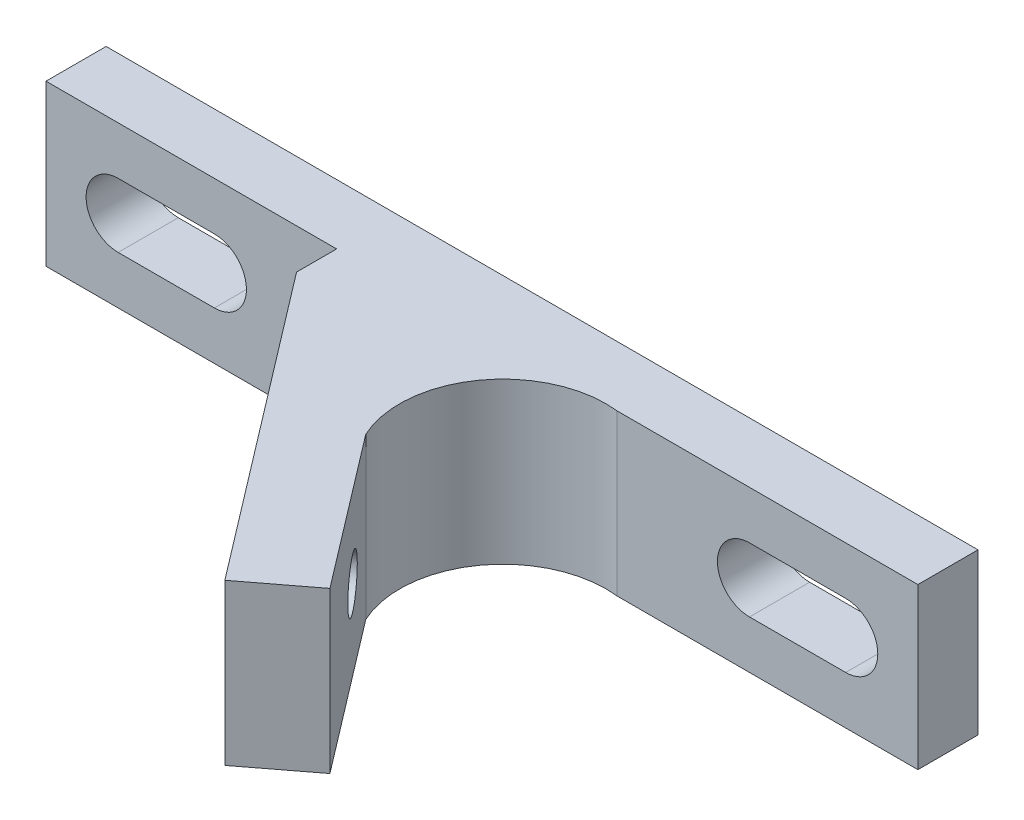
ISO-10303-21;
HEADER;
FILE_DESCRIPTION(('STEP AP214'),'2;1');
FILE_NAME('part.step','',(''),(''),'','','');
FILE_SCHEMA(('AUTOMOTIVE_DESIGN { 1 0 10303 214 1 1 1 1 }'));
ENDSEC;
DATA;
#1=APPLICATION_CONTEXT('core data for automotive mechanical design processes');
#2=APPLICATION_PROTOCOL_DEFINITION('international standard','automotive_design',2000,#1);
#3=PRODUCT_CONTEXT('',#1,'mechanical');
#4=PRODUCT('Part','Part','',(#3));
#5=PRODUCT_RELATED_PRODUCT_CATEGORY('part','',(#4));
#6=PRODUCT_DEFINITION_FORMATION('','',#4);
#7=PRODUCT_DEFINITION_CONTEXT('part definition',#1,'design');
#8=PRODUCT_DEFINITION('design','',#6,#7);
#9=PRODUCT_DEFINITION_SHAPE('','',#8);
#10=(LENGTH_UNIT() NAMED_UNIT(*) SI_UNIT(.MILLI.,.METRE.));
#11=(NAMED_UNIT(*) PLANE_ANGLE_UNIT() SI_UNIT($,.RADIAN.));
#12=(NAMED_UNIT(*) SI_UNIT($,.STERADIAN.) SOLID_ANGLE_UNIT());
#13=UNCERTAINTY_MEASURE_WITH_UNIT(LENGTH_MEASURE(1.E-05),#10,'distance_accuracy_value','');
#14=(GEOMETRIC_REPRESENTATION_CONTEXT(3) GLOBAL_UNCERTAINTY_ASSIGNED_CONTEXT((#13)) GLOBAL_UNIT_ASSIGNED_CONTEXT((#10,
#11,#12)) REPRESENTATION_CONTEXT('',''));
#15=CARTESIAN_POINT('',(0.,0.,0.));
#16=DIRECTION('',(0.,0.,1.));
#17=DIRECTION('',(1.,0.,0.));
#18=AXIS2_PLACEMENT_3D('',#15,#16,#17);
#19=CARTESIAN_POINT('',(-21.75,8.,0.));
#20=DIRECTION('',(1.,0.,0.));
#21=DIRECTION('',(0.,0.,-1.));
#22=AXIS2_PLACEMENT_3D('',#19,#20,#21);
#23=PLANE('',#22);
#24=DIRECTION('',(0.,0.,1.));
#25=VECTOR('',#24,1.);
#26=CARTESIAN_POINT('',(-21.75,0.,0.));
#27=LINE('',#26,#25);
#28=CARTESIAN_POINT('',(-21.75,0.,0.));
#29=VERTEX_POINT('',#28);
#30=CARTESIAN_POINT('',(-21.75,0.,3.));
#31=VERTEX_POINT('',#30);
#32=EDGE_CURVE('E227',#29,#31,#27,.T.);
#33=ORIENTED_EDGE('',*,*,#32,.T.);
#34=DIRECTION('',(0.,-1.,0.));
#35=VECTOR('',#34,1.);
#36=CARTESIAN_POINT('',(-21.75,8.,3.));
#37=LINE('',#36,#35);
#38=CARTESIAN_POINT('',(-21.75,8.,3.));
#39=VERTEX_POINT('',#38);
#40=EDGE_CURVE('E11',#39,#31,#37,.T.);
#41=ORIENTED_EDGE('',*,*,#40,.F.);
#42=DIRECTION('',(0.,0.,1.));
#43=VECTOR('',#42,1.);
#44=CARTESIAN_POINT('',(-21.75,8.,0.));
#45=LINE('',#44,#43);
#46=CARTESIAN_POINT('',(-21.75,8.,0.));
#47=VERTEX_POINT('',#46);
#48=EDGE_CURVE('E228',#47,#39,#45,.T.);
#49=ORIENTED_EDGE('',*,*,#48,.F.);
#50=DIRECTION('',(0.,-1.,0.));
#51=VECTOR('',#50,1.);
#52=CARTESIAN_POINT('',(-21.75,8.,0.));
#53=LINE('',#52,#51);
#54=EDGE_CURVE('E250',#47,#29,#53,.T.);
#55=ORIENTED_EDGE('',*,*,#54,.T.);
#56=EDGE_LOOP('',(#33,#41,#49,#55));
#57=FACE_BOUND('',#56,.T.);
#58=ADVANCED_FACE('F35',(#57),#23,.F.);
#59=CARTESIAN_POINT('',(-21.75,8.,3.));
#60=DIRECTION('',(0.,0.,-1.));
#61=DIRECTION('',(-1.,0.,0.));
#62=AXIS2_PLACEMENT_3D('',#59,#60,#61);
#63=PLANE('',#62);
#64=DIRECTION('',(1.,0.,0.));
#65=VECTOR('',#64,1.);
#66=CARTESIAN_POINT('',(-18.15,2.4,3.));
#67=LINE('',#66,#65);
#68=CARTESIAN_POINT('',(-18.15,2.4,3.));
#69=VERTEX_POINT('',#68);
#70=CARTESIAN_POINT('',(-13.35,2.4,3.));
#71=VERTEX_POINT('',#70);
#72=EDGE_CURVE('E180',#69,#71,#67,.T.);
#73=ORIENTED_EDGE('',*,*,#72,.F.);
#74=CARTESIAN_POINT('',(-18.15,4.,3.));
#75=DIRECTION('',(0.,0.,-1.));
#76=DIRECTION('',(-1.,0.,0.));
#77=AXIS2_PLACEMENT_3D('',#74,#75,#76);
#78=CIRCLE('',#77,1.6);
#79=CARTESIAN_POINT('',(-18.15,5.6,3.));
#80=VERTEX_POINT('',#79);
#81=EDGE_CURVE('E162',#80,#69,#78,.F.);
#82=ORIENTED_EDGE('',*,*,#81,.F.);
#83=DIRECTION('',(-1.,0.,0.));
#84=VECTOR('',#83,1.);
#85=CARTESIAN_POINT('',(-18.15,5.6,3.));
#86=LINE('',#85,#84);
#87=CARTESIAN_POINT('',(-13.35,5.6,3.));
#88=VERTEX_POINT('',#87);
#89=EDGE_CURVE('E171',#88,#80,#86,.T.);
#90=ORIENTED_EDGE('',*,*,#89,.F.);
#91=CARTESIAN_POINT('',(-13.35,4.,3.));
#92=DIRECTION('',(0.,0.,-1.));
#93=DIRECTION('',(-1.,0.,0.));
#94=AXIS2_PLACEMENT_3D('',#91,#92,#93);
#95=CIRCLE('',#94,1.6);
#96=EDGE_CURVE('E50',#71,#88,#95,.F.);
#97=ORIENTED_EDGE('',*,*,#96,.F.);
#98=EDGE_LOOP('',(#73,#82,#90,#97));
#99=FACE_BOUND('',#98,.T.);
#100=DIRECTION('',(1.,0.,0.));
#101=VECTOR('',#100,1.);
#102=CARTESIAN_POINT('',(-21.75,0.,3.));
#103=LINE('',#102,#101);
#104=CARTESIAN_POINT('',(-7.25000000000001,0.,3.));
#105=VERTEX_POINT('',#104);
#106=EDGE_CURVE('E253',#31,#105,#103,.T.);
#107=ORIENTED_EDGE('',*,*,#106,.T.);
#108=DIRECTION('',(0.,-1.,0.));
#109=VECTOR('',#108,1.);
#110=CARTESIAN_POINT('',(-7.25000000000001,8.,3.));
#111=LINE('',#110,#109);
#112=CARTESIAN_POINT('',(-7.25000000000001,8.,3.));
#113=VERTEX_POINT('',#112);
#114=EDGE_CURVE('E43',#113,#105,#111,.T.);
#115=ORIENTED_EDGE('',*,*,#114,.F.);
#116=DIRECTION('',(1.,0.,0.));
#117=VECTOR('',#116,1.);
#118=CARTESIAN_POINT('',(-21.75,8.,3.));
#119=LINE('',#118,#117);
#120=EDGE_CURVE('E231',#39,#113,#119,.T.);
#121=ORIENTED_EDGE('',*,*,#120,.F.);
#122=ORIENTED_EDGE('',*,*,#40,.T.);
#123=EDGE_LOOP('',(#107,#115,#121,#122));
#124=FACE_BOUND('',#123,.T.);
#125=ADVANCED_FACE('F177',(#99,#124),#63,.F.);
#126=CARTESIAN_POINT('',(-7.25000000000001,8.,3.));
#127=DIRECTION('',(1.,0.,0.));
#128=DIRECTION('',(0.,0.,-1.));
#129=AXIS2_PLACEMENT_3D('',#126,#127,#128);
#130=PLANE('',#129);
#131=DIRECTION('',(0.,0.,1.));
#132=VECTOR('',#131,1.);
#133=CARTESIAN_POINT('',(-7.25000000000001,0.,3.));
#134=LINE('',#133,#132);
#135=CARTESIAN_POINT('',(-7.25,0.,5.));
#136=VERTEX_POINT('',#135);
#137=EDGE_CURVE('E255',#105,#136,#134,.T.);
#138=ORIENTED_EDGE('',*,*,#137,.T.);
#139=DIRECTION('',(0.,-1.,0.));
#140=VECTOR('',#139,1.);
#141=CARTESIAN_POINT('',(-7.25,8.,5.));
#142=LINE('',#141,#140);
#143=CARTESIAN_POINT('',(-7.25,8.,5.));
#144=VERTEX_POINT('',#143);
#145=EDGE_CURVE('E290',#144,#136,#142,.T.);
#146=ORIENTED_EDGE('',*,*,#145,.F.);
#147=DIRECTION('',(0.,0.,1.));
#148=VECTOR('',#147,1.);
#149=CARTESIAN_POINT('',(-7.25000000000001,8.,3.));
#150=LINE('',#149,#148);
#151=EDGE_CURVE('E234',#113,#144,#150,.T.);
#152=ORIENTED_EDGE('',*,*,#151,.F.);
#153=ORIENTED_EDGE('',*,*,#114,.T.);
#154=EDGE_LOOP('',(#138,#146,#152,#153));
#155=FACE_BOUND('',#154,.T.);
#156=ADVANCED_FACE('F298',(#155),#130,.F.);
#157=CARTESIAN_POINT('',(-7.25,8.,5.));
#158=DIRECTION('',(0.794951704580711,0.,-0.606672718509925));
#159=DIRECTION('',(-0.606672718509925,0.,-0.794951704580711));
#160=AXIS2_PLACEMENT_3D('',#157,#158,#159);
#161=PLANE('',#160);
#162=CARTESIAN_POINT('',(-5.12664548521527,4.,7.78233096603249));
#163=DIRECTION('',(-0.794951704580711,0.,0.606672718509925));
#164=DIRECTION('',(0.606672718509925,0.,0.794951704580711));
#165=AXIS2_PLACEMENT_3D('',#162,#163,#164);
#166=CIRCLE('',#165,1.25);
#167=CARTESIAN_POINT('',(-4.36830458707786,4.,8.77602059675838));
#168=VERTEX_POINT('',#167);
#169=EDGE_CURVE('E369',#168,#168,#166,.T.);
#170=ORIENTED_EDGE('',*,*,#169,.F.);
#171=EDGE_LOOP('',(#170));
#172=FACE_BOUND('',#171,.T.);
#173=CARTESIAN_POINT('',(0.636745340629017,4.,15.3343721595492));
#174=DIRECTION('',(-0.794951704580711,0.,0.606672718509925));
#175=DIRECTION('',(0.606672718509925,0.,0.794951704580711));
#176=AXIS2_PLACEMENT_3D('',#173,#174,#175);
#177=CIRCLE('',#176,1.25);
#178=CARTESIAN_POINT('',(1.39508623876642,4.,16.3280617902751));
#179=VERTEX_POINT('',#178);
#180=EDGE_CURVE('E372',#179,#179,#177,.T.);
#181=ORIENTED_EDGE('',*,*,#180,.F.);
#182=EDGE_LOOP('',(#181));
#183=FACE_BOUND('',#182,.T.);
#184=DIRECTION('',(0.606672718509925,0.,0.794951704580711));
#185=VECTOR('',#184,1.);
#186=CARTESIAN_POINT('',(-7.25,0.,5.));
#187=LINE('',#186,#185);
#188=CARTESIAN_POINT('',(4.27678165168857,0.,20.1040823870335));
#189=VERTEX_POINT('',#188);
#190=EDGE_CURVE('E257',#136,#189,#187,.T.);
#191=ORIENTED_EDGE('',*,*,#190,.T.);
#192=DIRECTION('',(0.,-1.,0.));
#193=VECTOR('',#192,1.);
#194=CARTESIAN_POINT('',(4.27678165168857,8.,20.1040823870335));
#195=LINE('',#194,#193);
#196=CARTESIAN_POINT('',(4.27678165168857,8.,20.1040823870335));
#197=VERTEX_POINT('',#196);
#198=EDGE_CURVE('E287',#197,#189,#195,.T.);
#199=ORIENTED_EDGE('',*,*,#198,.F.);
#200=DIRECTION('',(0.606672718509925,0.,0.794951704580711));
#201=VECTOR('',#200,1.);
#202=CARTESIAN_POINT('',(-7.25,8.,5.));
#203=LINE('',#202,#201);
#204=EDGE_CURVE('E236',#144,#197,#203,.T.);
#205=ORIENTED_EDGE('',*,*,#204,.F.);
#206=ORIENTED_EDGE('',*,*,#145,.T.);
#207=EDGE_LOOP('',(#191,#199,#205,#206));
#208=FACE_BOUND('',#207,.T.);
#209=ADVANCED_FACE('F308',(#172,#183,#208),#161,.F.);
#210=CARTESIAN_POINT('',(4.27678165168857,8.,20.1040823870335));
#211=DIRECTION('',(-0.606672718509925,0.,-0.794951704580711));
#212=DIRECTION('',(-0.794951704580711,0.,0.606672718509925));
#213=AXIS2_PLACEMENT_3D('',#210,#211,#212);
#214=PLANE('',#213);
#215=DIRECTION('',(0.794951704580711,0.,-0.606672718509925));
#216=VECTOR('',#215,1.);
#217=CARTESIAN_POINT('',(4.27678165168857,0.,20.1040823870335));
#218=LINE('',#217,#216);
#219=CARTESIAN_POINT('',(7.25,0.,17.8350508877614));
#220=VERTEX_POINT('',#219);
#221=EDGE_CURVE('E259',#189,#220,#218,.T.);
#222=ORIENTED_EDGE('',*,*,#221,.T.);
#223=DIRECTION('',(0.,-1.,0.));
#224=VECTOR('',#223,1.);
#225=CARTESIAN_POINT('',(7.25,8.,17.8350508877614));
#226=LINE('',#225,#224);
#227=CARTESIAN_POINT('',(7.25,8.,17.8350508877614));
#228=VERTEX_POINT('',#227);
#229=EDGE_CURVE('E284',#228,#220,#226,.T.);
#230=ORIENTED_EDGE('',*,*,#229,.F.);
#231=DIRECTION('',(0.794951704580711,0.,-0.606672718509925));
#232=VECTOR('',#231,1.);
#233=CARTESIAN_POINT('',(4.27678165168857,8.,20.1040823870335));
#234=LINE('',#233,#232);
#235=EDGE_CURVE('E238',#197,#228,#234,.T.);
#236=ORIENTED_EDGE('',*,*,#235,.F.);
#237=ORIENTED_EDGE('',*,*,#198,.T.);
#238=EDGE_LOOP('',(#222,#230,#236,#237));
#239=FACE_BOUND('',#238,.T.);
#240=ADVANCED_FACE('F312',(#239),#214,.F.);
#241=CARTESIAN_POINT('',(7.25,8.,17.8350508877614));
#242=DIRECTION('',(-0.794951704580711,0.,0.606672718509925));
#243=DIRECTION('',(0.606672718509925,0.,0.794951704580711));
#244=AXIS2_PLACEMENT_3D('',#241,#242,#243);
#245=PLANE('',#244);
#246=CARTESIAN_POINT('',(3.60996368894045,4.,13.0653406602771));
#247=DIRECTION('',(-0.794951704580711,0.,0.606672718509925));
#248=DIRECTION('',(0.606672718509925,0.,0.794951704580711));
#249=AXIS2_PLACEMENT_3D('',#246,#247,#248);
#250=CIRCLE('',#249,1.25);
#251=CARTESIAN_POINT('',(4.36830458707786,4.,14.059030291003));
#252=VERTEX_POINT('',#251);
#253=EDGE_CURVE('E38',#252,#252,#250,.T.);
#254=ORIENTED_EDGE('',*,*,#253,.T.);
#255=EDGE_LOOP('',(#254));
#256=FACE_BOUND('',#255,.T.);
#257=DIRECTION('',(-0.606672718509925,0.,-0.794951704580711));
#258=VECTOR('',#257,1.);
#259=CARTESIAN_POINT('',(7.25,0.,17.8350508877614));
#260=LINE('',#259,#258);
#261=CARTESIAN_POINT('',(1.48660917415571,0.,10.2830096942446));
#262=VERTEX_POINT('',#261);
#263=EDGE_CURVE('E261',#220,#262,#260,.T.);
#264=ORIENTED_EDGE('',*,*,#263,.T.);
#265=DIRECTION('',(0.,-1.,0.));
#266=VECTOR('',#265,1.);
#267=CARTESIAN_POINT('',(1.48660917415571,8.,10.2830096942446));
#268=LINE('',#267,#266);
#269=CARTESIAN_POINT('',(1.48660917415571,8.,10.2830096942446));
#270=VERTEX_POINT('',#269);
#271=EDGE_CURVE('E281',#270,#262,#268,.T.);
#272=ORIENTED_EDGE('',*,*,#271,.F.);
#273=DIRECTION('',(-0.606672718509925,0.,-0.794951704580711));
#274=VECTOR('',#273,1.);
#275=CARTESIAN_POINT('',(7.25,8.,17.8350508877614));
#276=LINE('',#275,#274);
#277=EDGE_CURVE('E240',#228,#270,#276,.T.);
#278=ORIENTED_EDGE('',*,*,#277,.F.);
#279=ORIENTED_EDGE('',*,*,#229,.T.);
#280=EDGE_LOOP('',(#264,#272,#278,#279));
#281=FACE_BOUND('',#280,.T.);
#282=ADVANCED_FACE('F342',(#256,#281),#245,.F.);
#283=CARTESIAN_POINT('',(6.15967015204307,8.,8.11678845072965));
#284=DIRECTION('',(0.,-1.,0.));
#285=DIRECTION('',(0.,0.,-1.));
#286=AXIS2_PLACEMENT_3D('',#283,#284,#285);
#287=CYLINDRICAL_SURFACE('',#286,5.15072940260981);
#288=CARTESIAN_POINT('',(6.15967015204307,0.,8.11678845072965));
#289=DIRECTION('',(0.,-1.,0.));
#290=DIRECTION('',(0.,0.,-1.));
#291=AXIS2_PLACEMENT_3D('',#288,#289,#290);
#292=CIRCLE('',#291,5.15072940260981);
#293=CARTESIAN_POINT('',(6.75,0.,3.));
#294=VERTEX_POINT('',#293);
#295=EDGE_CURVE('E263',#262,#294,#292,.T.);
#296=ORIENTED_EDGE('',*,*,#295,.T.);
#297=DIRECTION('',(0.,-1.,0.));
#298=VECTOR('',#297,1.);
#299=CARTESIAN_POINT('',(6.75,8.,3.));
#300=LINE('',#299,#298);
#301=CARTESIAN_POINT('',(6.75,8.,3.));
#302=VERTEX_POINT('',#301);
#303=EDGE_CURVE('E278',#302,#294,#300,.T.);
#304=ORIENTED_EDGE('',*,*,#303,.F.);
#305=CARTESIAN_POINT('',(6.15967015204307,8.,8.11678845072965));
#306=DIRECTION('',(0.,-1.,0.));
#307=DIRECTION('',(0.,0.,-1.));
#308=AXIS2_PLACEMENT_3D('',#305,#306,#307);
#309=CIRCLE('',#308,5.15072940260981);
#310=EDGE_CURVE('E242',#270,#302,#309,.T.);
#311=ORIENTED_EDGE('',*,*,#310,.F.);
#312=ORIENTED_EDGE('',*,*,#271,.T.);
#313=EDGE_LOOP('',(#296,#304,#311,#312));
#314=FACE_BOUND('',#313,.T.);
#315=ADVANCED_FACE('F339',(#314),#287,.F.);
#316=CARTESIAN_POINT('',(21.75,8.,3.));
#317=DIRECTION('',(0.,0.,-1.));
#318=DIRECTION('',(-1.,0.,0.));
#319=AXIS2_PLACEMENT_3D('',#316,#317,#318);
#320=PLANE('',#319);
#321=DIRECTION('',(-1.,0.,0.));
#322=VECTOR('',#321,1.);
#323=CARTESIAN_POINT('',(18.15,5.6,3.));
#324=LINE('',#323,#322);
#325=CARTESIAN_POINT('',(18.15,5.6,3.));
#326=VERTEX_POINT('',#325);
#327=CARTESIAN_POINT('',(13.35,5.6,3.));
#328=VERTEX_POINT('',#327);
#329=EDGE_CURVE('E198',#326,#328,#324,.T.);
#330=ORIENTED_EDGE('',*,*,#329,.F.);
#331=CARTESIAN_POINT('',(18.15,4.,3.));
#332=DIRECTION('',(0.,0.,-1.));
#333=DIRECTION('',(-1.,0.,0.));
#334=AXIS2_PLACEMENT_3D('',#331,#332,#333);
#335=CIRCLE('',#334,1.6);
#336=CARTESIAN_POINT('',(18.15,2.4,3.));
#337=VERTEX_POINT('',#336);
#338=EDGE_CURVE('E201',#337,#326,#335,.F.);
#339=ORIENTED_EDGE('',*,*,#338,.F.);
#340=DIRECTION('',(1.,0.,0.));
#341=VECTOR('',#340,1.);
#342=CARTESIAN_POINT('',(18.15,2.4,3.));
#343=LINE('',#342,#341);
#344=CARTESIAN_POINT('',(13.35,2.4,3.));
#345=VERTEX_POINT('',#344);
#346=EDGE_CURVE('E218',#345,#337,#343,.T.);
#347=ORIENTED_EDGE('',*,*,#346,.F.);
#348=CARTESIAN_POINT('',(13.35,4.,3.));
#349=DIRECTION('',(0.,0.,-1.));
#350=DIRECTION('',(-1.,0.,0.));
#351=AXIS2_PLACEMENT_3D('',#348,#349,#350);
#352=CIRCLE('',#351,1.6);
#353=EDGE_CURVE('E174',#328,#345,#352,.F.);
#354=ORIENTED_EDGE('',*,*,#353,.F.);
#355=EDGE_LOOP('',(#330,#339,#347,#354));
#356=FACE_BOUND('',#355,.T.);
#357=DIRECTION('',(1.,0.,0.));
#358=VECTOR('',#357,1.);
#359=CARTESIAN_POINT('',(21.75,0.,3.));
#360=LINE('',#359,#358);
#361=CARTESIAN_POINT('',(21.75,0.,3.));
#362=VERTEX_POINT('',#361);
#363=EDGE_CURVE('E265',#294,#362,#360,.T.);
#364=ORIENTED_EDGE('',*,*,#363,.T.);
#365=DIRECTION('',(0.,-1.,0.));
#366=VECTOR('',#365,1.);
#367=CARTESIAN_POINT('',(21.75,8.,3.));
#368=LINE('',#367,#366);
#369=CARTESIAN_POINT('',(21.75,8.,3.));
#370=VERTEX_POINT('',#369);
#371=EDGE_CURVE('E275',#370,#362,#368,.T.);
#372=ORIENTED_EDGE('',*,*,#371,.F.);
#373=DIRECTION('',(1.,0.,0.));
#374=VECTOR('',#373,1.);
#375=CARTESIAN_POINT('',(21.75,8.,3.));
#376=LINE('',#375,#374);
#377=EDGE_CURVE('E244',#302,#370,#376,.T.);
#378=ORIENTED_EDGE('',*,*,#377,.F.);
#379=ORIENTED_EDGE('',*,*,#303,.T.);
#380=EDGE_LOOP('',(#364,#372,#378,#379));
#381=FACE_BOUND('',#380,.T.);
#382=ADVANCED_FACE('F335',(#356,#381),#320,.F.);
#383=CARTESIAN_POINT('',(21.75,8.,0.));
#384=DIRECTION('',(-1.,0.,0.));
#385=DIRECTION('',(0.,0.,1.));
#386=AXIS2_PLACEMENT_3D('',#383,#384,#385);
#387=PLANE('',#386);
#388=DIRECTION('',(0.,0.,-1.));
#389=VECTOR('',#388,1.);
#390=CARTESIAN_POINT('',(21.75,0.,0.));
#391=LINE('',#390,#389);
#392=CARTESIAN_POINT('',(21.75,0.,0.));
#393=VERTEX_POINT('',#392);
#394=EDGE_CURVE('E267',#362,#393,#391,.T.);
#395=ORIENTED_EDGE('',*,*,#394,.T.);
#396=DIRECTION('',(0.,-1.,0.));
#397=VECTOR('',#396,1.);
#398=CARTESIAN_POINT('',(21.75,8.,0.));
#399=LINE('',#398,#397);
#400=CARTESIAN_POINT('',(21.75,8.,0.));
#401=VERTEX_POINT('',#400);
#402=EDGE_CURVE('E272',#401,#393,#399,.T.);
#403=ORIENTED_EDGE('',*,*,#402,.F.);
#404=DIRECTION('',(0.,0.,-1.));
#405=VECTOR('',#404,1.);
#406=CARTESIAN_POINT('',(21.75,8.,0.));
#407=LINE('',#406,#405);
#408=EDGE_CURVE('E246',#370,#401,#407,.T.);
#409=ORIENTED_EDGE('',*,*,#408,.F.);
#410=ORIENTED_EDGE('',*,*,#371,.T.);
#411=EDGE_LOOP('',(#395,#403,#409,#410));
#412=FACE_BOUND('',#411,.T.);
#413=ADVANCED_FACE('F331',(#412),#387,.F.);
#414=CARTESIAN_POINT('',(-21.75,8.,0.));
#415=DIRECTION('',(0.,0.,1.));
#416=DIRECTION('',(1.,0.,0.));
#417=AXIS2_PLACEMENT_3D('',#414,#415,#416);
#418=PLANE('',#417);
#419=DIRECTION('',(1.,0.,0.));
#420=VECTOR('',#419,1.);
#421=CARTESIAN_POINT('',(-18.15,5.6,0.));
#422=LINE('',#421,#420);
#423=CARTESIAN_POINT('',(-18.15,5.6,0.));
#424=VERTEX_POINT('',#423);
#425=CARTESIAN_POINT('',(-13.35,5.6,0.));
#426=VERTEX_POINT('',#425);
#427=EDGE_CURVE('E182',#424,#426,#422,.T.);
#428=ORIENTED_EDGE('',*,*,#427,.F.);
#429=CARTESIAN_POINT('',(-18.15,4.,0.));
#430=DIRECTION('',(0.,0.,-1.));
#431=DIRECTION('',(1.,0.,0.));
#432=AXIS2_PLACEMENT_3D('',#429,#430,#431);
#433=CIRCLE('',#432,1.6);
#434=CARTESIAN_POINT('',(-18.15,2.4,0.));
#435=VERTEX_POINT('',#434);
#436=EDGE_CURVE('E58',#435,#424,#433,.T.);
#437=ORIENTED_EDGE('',*,*,#436,.F.);
#438=DIRECTION('',(-1.,0.,0.));
#439=VECTOR('',#438,1.);
#440=CARTESIAN_POINT('',(-18.15,2.4,0.));
#441=LINE('',#440,#439);
#442=CARTESIAN_POINT('',(-13.35,2.4,0.));
#443=VERTEX_POINT('',#442);
#444=EDGE_CURVE('E168',#443,#435,#441,.T.);
#445=ORIENTED_EDGE('',*,*,#444,.F.);
#446=CARTESIAN_POINT('',(-13.35,4.,0.));
#447=DIRECTION('',(0.,0.,-1.));
#448=DIRECTION('',(1.,0.,0.));
#449=AXIS2_PLACEMENT_3D('',#446,#447,#448);
#450=CIRCLE('',#449,1.6);
#451=EDGE_CURVE('E188',#426,#443,#450,.T.);
#452=ORIENTED_EDGE('',*,*,#451,.F.);
#453=EDGE_LOOP('',(#428,#437,#445,#452));
#454=FACE_BOUND('',#453,.T.);
#455=DIRECTION('',(-1.,0.,0.));
#456=VECTOR('',#455,1.);
#457=CARTESIAN_POINT('',(18.15,2.4,0.));
#458=LINE('',#457,#456);
#459=CARTESIAN_POINT('',(18.15,2.4,0.));
#460=VERTEX_POINT('',#459);
#461=CARTESIAN_POINT('',(13.35,2.4,0.));
#462=VERTEX_POINT('',#461);
#463=EDGE_CURVE('E206',#460,#462,#458,.T.);
#464=ORIENTED_EDGE('',*,*,#463,.F.);
#465=CARTESIAN_POINT('',(18.15,4.,0.));
#466=DIRECTION('',(0.,0.,-1.));
#467=DIRECTION('',(-1.,0.,0.));
#468=AXIS2_PLACEMENT_3D('',#465,#466,#467);
#469=CIRCLE('',#468,1.6);
#470=CARTESIAN_POINT('',(18.15,5.6,0.));
#471=VERTEX_POINT('',#470);
#472=EDGE_CURVE('E204',#471,#460,#469,.T.);
#473=ORIENTED_EDGE('',*,*,#472,.F.);
#474=DIRECTION('',(1.,0.,0.));
#475=VECTOR('',#474,1.);
#476=CARTESIAN_POINT('',(18.15,5.6,0.));
#477=LINE('',#476,#475);
#478=CARTESIAN_POINT('',(13.35,5.6,0.));
#479=VERTEX_POINT('',#478);
#480=EDGE_CURVE('E212',#479,#471,#477,.T.);
#481=ORIENTED_EDGE('',*,*,#480,.F.);
#482=CARTESIAN_POINT('',(13.35,4.,0.));
#483=DIRECTION('',(0.,0.,-1.));
#484=DIRECTION('',(-1.,0.,0.));
#485=AXIS2_PLACEMENT_3D('',#482,#483,#484);
#486=CIRCLE('',#485,1.6);
#487=EDGE_CURVE('E209',#462,#479,#486,.T.);
#488=ORIENTED_EDGE('',*,*,#487,.F.);
#489=EDGE_LOOP('',(#464,#473,#481,#488));
#490=FACE_BOUND('',#489,.T.);
#491=DIRECTION('',(-1.,0.,0.));
#492=VECTOR('',#491,1.);
#493=CARTESIAN_POINT('',(-21.75,0.,0.));
#494=LINE('',#493,#492);
#495=EDGE_CURVE('E232',#393,#29,#494,.T.);
#496=ORIENTED_EDGE('',*,*,#495,.T.);
#497=ORIENTED_EDGE('',*,*,#54,.F.);
#498=DIRECTION('',(-1.,0.,0.));
#499=VECTOR('',#498,1.);
#500=CARTESIAN_POINT('',(-21.75,8.,0.));
#501=LINE('',#500,#499);
#502=EDGE_CURVE('E248',#401,#47,#501,.T.);
#503=ORIENTED_EDGE('',*,*,#502,.F.);
#504=ORIENTED_EDGE('',*,*,#402,.T.);
#505=EDGE_LOOP('',(#496,#497,#503,#504));
#506=FACE_BOUND('',#505,.T.);
#507=ADVANCED_FACE('F326',(#454,#490,#506),#418,.F.);
#508=CARTESIAN_POINT('',(6.15967015204307,8.,8.11678845072965));
#509=DIRECTION('',(0.,-1.,0.));
#510=DIRECTION('',(0.,0.,-1.));
#511=AXIS2_PLACEMENT_3D('',#508,#509,#510);
#512=PLANE('',#511);
#513=ORIENTED_EDGE('',*,*,#48,.T.);
#514=ORIENTED_EDGE('',*,*,#120,.T.);
#515=ORIENTED_EDGE('',*,*,#151,.T.);
#516=ORIENTED_EDGE('',*,*,#204,.T.);
#517=ORIENTED_EDGE('',*,*,#235,.T.);
#518=ORIENTED_EDGE('',*,*,#277,.T.);
#519=ORIENTED_EDGE('',*,*,#310,.T.);
#520=ORIENTED_EDGE('',*,*,#377,.T.);
#521=ORIENTED_EDGE('',*,*,#408,.T.);
#522=ORIENTED_EDGE('',*,*,#502,.T.);
#523=EDGE_LOOP('',(#513,#514,#515,#516,#517,#518,#519,#520,#521,#522));
#524=FACE_BOUND('',#523,.T.);
#525=ADVANCED_FACE('F316',(#524),#512,.F.);
#526=CARTESIAN_POINT('',(6.15967015204307,0.,8.11678845072965));
#527=DIRECTION('',(0.,-1.,0.));
#528=DIRECTION('',(0.,0.,-1.));
#529=AXIS2_PLACEMENT_3D('',#526,#527,#528);
#530=PLANE('',#529);
#531=ORIENTED_EDGE('',*,*,#32,.F.);
#532=ORIENTED_EDGE('',*,*,#495,.F.);
#533=ORIENTED_EDGE('',*,*,#394,.F.);
#534=ORIENTED_EDGE('',*,*,#363,.F.);
#535=ORIENTED_EDGE('',*,*,#295,.F.);
#536=ORIENTED_EDGE('',*,*,#263,.F.);
#537=ORIENTED_EDGE('',*,*,#221,.F.);
#538=ORIENTED_EDGE('',*,*,#190,.F.);
#539=ORIENTED_EDGE('',*,*,#137,.F.);
#540=ORIENTED_EDGE('',*,*,#106,.F.);
#541=EDGE_LOOP('',(#531,#532,#533,#534,#535,#536,#537,#538,#539,#540));
#542=FACE_BOUND('',#541,.T.);
#543=ADVANCED_FACE('F303',(#542),#530,.T.);
#544=CARTESIAN_POINT('',(18.15,4.,20.1050823870335));
#545=DIRECTION('',(0.,0.,-1.));
#546=DIRECTION('',(-1.,0.,0.));
#547=AXIS2_PLACEMENT_3D('',#544,#545,#546);
#548=CYLINDRICAL_SURFACE('',#547,1.6);
#549=ORIENTED_EDGE('',*,*,#338,.T.);
#550=DIRECTION('',(0.,0.,-1.));
#551=VECTOR('',#550,1.);
#552=CARTESIAN_POINT('',(18.15,5.6,20.1050823870335));
#553=LINE('',#552,#551);
#554=EDGE_CURVE('E216',#326,#471,#553,.T.);
#555=ORIENTED_EDGE('',*,*,#554,.T.);
#556=ORIENTED_EDGE('',*,*,#472,.T.);
#557=DIRECTION('',(0.,0.,-1.));
#558=VECTOR('',#557,1.);
#559=CARTESIAN_POINT('',(18.15,2.4,20.1050823870335));
#560=LINE('',#559,#558);
#561=EDGE_CURVE('E215',#337,#460,#560,.T.);
#562=ORIENTED_EDGE('',*,*,#561,.F.);
#563=EDGE_LOOP('',(#549,#555,#556,#562));
#564=FACE_BOUND('',#563,.T.);
#565=ADVANCED_FACE('F411',(#564),#548,.F.);
#566=CARTESIAN_POINT('',(18.15,5.6,20.1050823870335));
#567=DIRECTION('',(0.,1.,0.));
#568=DIRECTION('',(0.,0.,1.));
#569=AXIS2_PLACEMENT_3D('',#566,#567,#568);
#570=PLANE('',#569);
#571=ORIENTED_EDGE('',*,*,#329,.T.);
#572=DIRECTION('',(0.,0.,-1.));
#573=VECTOR('',#572,1.);
#574=CARTESIAN_POINT('',(13.35,5.6,20.1050823870335));
#575=LINE('',#574,#573);
#576=EDGE_CURVE('E219',#328,#479,#575,.T.);
#577=ORIENTED_EDGE('',*,*,#576,.T.);
#578=ORIENTED_EDGE('',*,*,#480,.T.);
#579=ORIENTED_EDGE('',*,*,#554,.F.);
#580=EDGE_LOOP('',(#571,#577,#578,#579));
#581=FACE_BOUND('',#580,.T.);
#582=ADVANCED_FACE('F407',(#581),#570,.F.);
#583=CARTESIAN_POINT('',(13.35,4.,20.1050823870335));
#584=DIRECTION('',(0.,0.,-1.));
#585=DIRECTION('',(-1.,0.,0.));
#586=AXIS2_PLACEMENT_3D('',#583,#584,#585);
#587=CYLINDRICAL_SURFACE('',#586,1.6);
#588=ORIENTED_EDGE('',*,*,#353,.T.);
#589=DIRECTION('',(0.,0.,-1.));
#590=VECTOR('',#589,1.);
#591=CARTESIAN_POINT('',(13.35,2.4,20.1050823870335));
#592=LINE('',#591,#590);
#593=EDGE_CURVE('E221',#345,#462,#592,.T.);
#594=ORIENTED_EDGE('',*,*,#593,.T.);
#595=ORIENTED_EDGE('',*,*,#487,.T.);
#596=ORIENTED_EDGE('',*,*,#576,.F.);
#597=EDGE_LOOP('',(#588,#594,#595,#596));
#598=FACE_BOUND('',#597,.T.);
#599=ADVANCED_FACE('F410',(#598),#587,.F.);
#600=CARTESIAN_POINT('',(18.15,2.4,20.1050823870335));
#601=DIRECTION('',(0.,-1.,0.));
#602=DIRECTION('',(0.,0.,-1.));
#603=AXIS2_PLACEMENT_3D('',#600,#601,#602);
#604=PLANE('',#603);
#605=ORIENTED_EDGE('',*,*,#346,.T.);
#606=ORIENTED_EDGE('',*,*,#561,.T.);
#607=ORIENTED_EDGE('',*,*,#463,.T.);
#608=ORIENTED_EDGE('',*,*,#593,.F.);
#609=EDGE_LOOP('',(#605,#606,#607,#608));
#610=FACE_BOUND('',#609,.T.);
#611=ADVANCED_FACE('F406',(#610),#604,.F.);
#612=CARTESIAN_POINT('',(-18.15,4.,20.1050823870335));
#613=DIRECTION('',(0.,0.,-1.));
#614=DIRECTION('',(-1.,0.,0.));
#615=AXIS2_PLACEMENT_3D('',#612,#613,#614);
#616=CYLINDRICAL_SURFACE('',#615,1.6);
#617=ORIENTED_EDGE('',*,*,#81,.T.);
#618=DIRECTION('',(0.,0.,-1.));
#619=VECTOR('',#618,1.);
#620=CARTESIAN_POINT('',(-18.15,2.4,20.1050823870335));
#621=LINE('',#620,#619);
#622=EDGE_CURVE('E175',#69,#435,#621,.T.);
#623=ORIENTED_EDGE('',*,*,#622,.T.);
#624=ORIENTED_EDGE('',*,*,#436,.T.);
#625=DIRECTION('',(0.,0.,-1.));
#626=VECTOR('',#625,1.);
#627=CARTESIAN_POINT('',(-18.15,5.6,20.1050823870335));
#628=LINE('',#627,#626);
#629=EDGE_CURVE('E158',#80,#424,#628,.T.);
#630=ORIENTED_EDGE('',*,*,#629,.F.);
#631=EDGE_LOOP('',(#617,#623,#624,#630));
#632=FACE_BOUND('',#631,.T.);
#633=ADVANCED_FACE('F160',(#632),#616,.F.);
#634=CARTESIAN_POINT('',(-18.15,2.4,20.1050823870335));
#635=DIRECTION('',(0.,-1.,0.));
#636=DIRECTION('',(0.,0.,-1.));
#637=AXIS2_PLACEMENT_3D('',#634,#635,#636);
#638=PLANE('',#637);
#639=ORIENTED_EDGE('',*,*,#72,.T.);
#640=DIRECTION('',(0.,0.,-1.));
#641=VECTOR('',#640,1.);
#642=CARTESIAN_POINT('',(-13.35,2.4,20.1050823870335));
#643=LINE('',#642,#641);
#644=EDGE_CURVE('E194',#71,#443,#643,.T.);
#645=ORIENTED_EDGE('',*,*,#644,.T.);
#646=ORIENTED_EDGE('',*,*,#444,.T.);
#647=ORIENTED_EDGE('',*,*,#622,.F.);
#648=EDGE_LOOP('',(#639,#645,#646,#647));
#649=FACE_BOUND('',#648,.T.);
#650=ADVANCED_FACE('F395',(#649),#638,.F.);
#651=CARTESIAN_POINT('',(-13.35,4.,20.1050823870335));
#652=DIRECTION('',(0.,0.,-1.));
#653=DIRECTION('',(-1.,0.,0.));
#654=AXIS2_PLACEMENT_3D('',#651,#652,#653);
#655=CYLINDRICAL_SURFACE('',#654,1.6);
#656=ORIENTED_EDGE('',*,*,#96,.T.);
#657=DIRECTION('',(0.,0.,-1.));
#658=VECTOR('',#657,1.);
#659=CARTESIAN_POINT('',(-13.35,5.6,20.1050823870335));
#660=LINE('',#659,#658);
#661=EDGE_CURVE('E167',#88,#426,#660,.T.);
#662=ORIENTED_EDGE('',*,*,#661,.T.);
#663=ORIENTED_EDGE('',*,*,#451,.T.);
#664=ORIENTED_EDGE('',*,*,#644,.F.);
#665=EDGE_LOOP('',(#656,#662,#663,#664));
#666=FACE_BOUND('',#665,.T.);
#667=ADVANCED_FACE('F398',(#666),#655,.F.);
#668=CARTESIAN_POINT('',(-18.15,5.6,20.1050823870335));
#669=DIRECTION('',(0.,1.,0.));
#670=DIRECTION('',(0.,0.,1.));
#671=AXIS2_PLACEMENT_3D('',#668,#669,#670);
#672=PLANE('',#671);
#673=ORIENTED_EDGE('',*,*,#89,.T.);
#674=ORIENTED_EDGE('',*,*,#629,.T.);
#675=ORIENTED_EDGE('',*,*,#427,.T.);
#676=ORIENTED_EDGE('',*,*,#661,.F.);
#677=EDGE_LOOP('',(#673,#674,#675,#676));
#678=FACE_BOUND('',#677,.T.);
#679=ADVANCED_FACE('F172',(#678),#672,.F.);
#680=CARTESIAN_POINT('',(5.40645556811328,4.,11.6943358484897));
#681=DIRECTION('',(-0.794951704580711,0.,0.606672718509925));
#682=DIRECTION('',(0.606672718509925,0.,0.794951704580711));
#683=AXIS2_PLACEMENT_3D('',#680,#681,#682);
#684=CYLINDRICAL_SURFACE('',#683,1.25);
#685=ORIENTED_EDGE('',*,*,#180,.T.);
#686=EDGE_LOOP('',(#685));
#687=FACE_BOUND('',#686,.T.);
#688=ORIENTED_EDGE('',*,*,#253,.F.);
#689=EDGE_LOOP('',(#688));
#690=FACE_BOUND('',#689,.T.);
#691=ADVANCED_FACE('F383',(#687,#690),#684,.F.);
#692=CARTESIAN_POINT('',(-0.356935257731,4.,4.14229465497294));
#693=DIRECTION('',(-0.794951704580711,0.,0.606672718509925));
#694=DIRECTION('',(0.606672718509925,0.,0.794951704580711));
#695=AXIS2_PLACEMENT_3D('',#692,#693,#694);
#696=CYLINDRICAL_SURFACE('',#695,1.25);
#697=CARTESIAN_POINT('',(-0.356935257731,4.,4.14229465497294));
#698=DIRECTION('',(-0.794951704580711,0.,0.606672718509925));
#699=DIRECTION('',(0.606672718509925,0.,0.794951704580711));
#700=AXIS2_PLACEMENT_3D('',#697,#698,#699);
#701=CIRCLE('',#700,1.25);
#702=CARTESIAN_POINT('',(0.401405640406407,4.,5.13598428569883));
#703=VERTEX_POINT('',#702);
#704=EDGE_CURVE('E374',#703,#703,#701,.T.);
#705=ORIENTED_EDGE('',*,*,#704,.F.);
#706=EDGE_LOOP('',(#705));
#707=FACE_BOUND('',#706,.T.);
#708=ORIENTED_EDGE('',*,*,#169,.T.);
#709=EDGE_LOOP('',(#708));
#710=FACE_BOUND('',#709,.T.);
#711=ADVANCED_FACE('F380',(#707,#710),#696,.F.);
#712=CARTESIAN_POINT('',(-0.356935257731,4.,4.14229465497294));
#713=DIRECTION('',(-0.794951704580711,0.,0.606672718509925));
#714=DIRECTION('',(0.606672718509925,0.,0.794951704580711));
#715=AXIS2_PLACEMENT_3D('',#712,#713,#714);
#716=PLANE('',#715);
#717=ORIENTED_EDGE('',*,*,#704,.T.);
#718=EDGE_LOOP('',(#717));
#719=FACE_BOUND('',#718,.T.);
#720=ADVANCED_FACE('F382',(#719),#716,.T.);
#721=CLOSED_SHELL('',(#58,#125,#156,#209,#240,#282,#315,#382,#413,#507,#525,#543,#565,#582,#599,
#611,#633,#650,#667,#679,#691,#711,#720));
#722=MANIFOLD_SOLID_BREP('B2',#721);
#723=ADVANCED_BREP_SHAPE_REPRESENTATION('',(#18,#722),#14);
#724=SHAPE_DEFINITION_REPRESENTATION(#9,#723);
ENDSEC;
END-ISO-10303-21;
